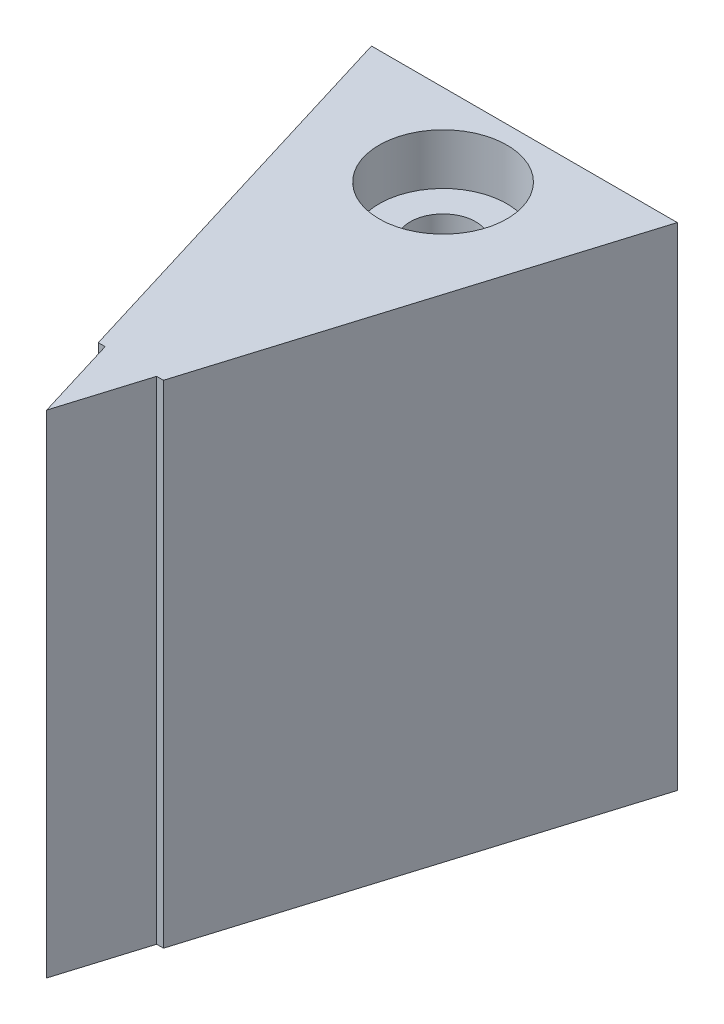
ISO-10303-21;
HEADER;
FILE_DESCRIPTION(('STEP AP214'),'2;1');
FILE_NAME('part.step','',(''),(''),'','','');
FILE_SCHEMA(('AUTOMOTIVE_DESIGN { 1 0 10303 214 1 1 1 1 }'));
ENDSEC;
DATA;
#1=APPLICATION_CONTEXT('core data for automotive mechanical design processes');
#2=APPLICATION_PROTOCOL_DEFINITION('international standard','automotive_design',2000,#1);
#3=PRODUCT_CONTEXT('',#1,'mechanical');
#4=PRODUCT('Part','Part','',(#3));
#5=PRODUCT_RELATED_PRODUCT_CATEGORY('part','',(#4));
#6=PRODUCT_DEFINITION_FORMATION('','',#4);
#7=PRODUCT_DEFINITION_CONTEXT('part definition',#1,'design');
#8=PRODUCT_DEFINITION('design','',#6,#7);
#9=PRODUCT_DEFINITION_SHAPE('','',#8);
#10=(LENGTH_UNIT() NAMED_UNIT(*) SI_UNIT(.MILLI.,.METRE.));
#11=(NAMED_UNIT(*) PLANE_ANGLE_UNIT() SI_UNIT($,.RADIAN.));
#12=(NAMED_UNIT(*) SI_UNIT($,.STERADIAN.) SOLID_ANGLE_UNIT());
#13=UNCERTAINTY_MEASURE_WITH_UNIT(LENGTH_MEASURE(1.E-05),#10,'distance_accuracy_value','');
#14=(GEOMETRIC_REPRESENTATION_CONTEXT(3) GLOBAL_UNCERTAINTY_ASSIGNED_CONTEXT((#13)) GLOBAL_UNIT_ASSIGNED_CONTEXT((#10,
#11,#12)) REPRESENTATION_CONTEXT('',''));
#15=CARTESIAN_POINT('',(0.,0.,0.));
#16=DIRECTION('',(0.,0.,1.));
#17=DIRECTION('',(1.,0.,0.));
#18=AXIS2_PLACEMENT_3D('',#15,#16,#17);
#19=CARTESIAN_POINT('',(-1.01365400260447,-2.51,16.5653700090289));
#20=DIRECTION('',(0.,0.,-1.));
#21=DIRECTION('',(-1.,0.,0.));
#22=AXIS2_PLACEMENT_3D('',#19,#20,#21);
#23=PLANE('',#22);
#24=DIRECTION('',(0.,1.,0.));
#25=VECTOR('',#24,1.);
#26=CARTESIAN_POINT('',(-0.804515651307037,-2.51,16.5653700090289));
#27=LINE('',#26,#25);
#28=CARTESIAN_POINT('',(-0.804515651307037,-2.5,16.5653700090289));
#29=VERTEX_POINT('',#28);
#30=CARTESIAN_POINT('',(-0.804515651307037,12.5,16.5653700090289));
#31=VERTEX_POINT('',#30);
#32=EDGE_CURVE('E11',#29,#31,#27,.T.);
#33=ORIENTED_EDGE('',*,*,#32,.T.);
#34=DIRECTION('',(-1.,0.,0.));
#35=VECTOR('',#34,1.);
#36=CARTESIAN_POINT('',(0.,12.5,16.5653700090289));
#37=LINE('',#36,#35);
#38=CARTESIAN_POINT('',(-1.01365400260447,12.5,16.5653700090289));
#39=VERTEX_POINT('',#38);
#40=EDGE_CURVE('E196',#31,#39,#37,.T.);
#41=ORIENTED_EDGE('',*,*,#40,.T.);
#42=DIRECTION('',(0.,-1.,0.));
#43=VECTOR('',#42,1.);
#44=CARTESIAN_POINT('',(-1.01365400260447,-2.5,16.5653700090289));
#45=LINE('',#44,#43);
#46=CARTESIAN_POINT('',(-1.01365400260447,-2.5,16.5653700090289));
#47=VERTEX_POINT('',#46);
#48=EDGE_CURVE('E54',#39,#47,#45,.T.);
#49=ORIENTED_EDGE('',*,*,#48,.T.);
#50=DIRECTION('',(-1.,0.,0.));
#51=VECTOR('',#50,1.);
#52=CARTESIAN_POINT('',(0.,-2.5,16.5653700090289));
#53=LINE('',#52,#51);
#54=EDGE_CURVE('E184',#29,#47,#53,.T.);
#55=ORIENTED_EDGE('',*,*,#54,.F.);
#56=EDGE_LOOP('',(#33,#41,#49,#55));
#57=FACE_BOUND('',#56,.T.);
#58=ADVANCED_FACE('F37',(#57),#23,.F.);
#59=CARTESIAN_POINT('',(-0.0200292878637935,-2.51,19.1313092850622));
#60=DIRECTION('',(0.956304755963033,0.,-0.292371704722745));
#61=DIRECTION('',(-0.292371704722745,0.,-0.956304755963033));
#62=AXIS2_PLACEMENT_3D('',#59,#60,#61);
#63=PLANE('',#62);
#64=DIRECTION('',(0.,1.,0.));
#65=VECTOR('',#64,1.);
#66=CARTESIAN_POINT('',(-0.0200292878637935,-2.51,19.1313092850622));
#67=LINE('',#66,#65);
#68=CARTESIAN_POINT('',(-0.0200292878637948,-2.5,19.1313092850622));
#69=VERTEX_POINT('',#68);
#70=CARTESIAN_POINT('',(-0.0200292878637948,12.5,19.1313092850622));
#71=VERTEX_POINT('',#70);
#72=EDGE_CURVE('E46',#69,#71,#67,.T.);
#73=ORIENTED_EDGE('',*,*,#72,.T.);
#74=DIRECTION('',(-0.292371704722745,0.,-0.956304755963033));
#75=VECTOR('',#74,1.);
#76=CARTESIAN_POINT('',(-5.36736335318275,12.5,1.64096765560485));
#77=LINE('',#76,#75);
#78=EDGE_CURVE('E199',#71,#31,#77,.T.);
#79=ORIENTED_EDGE('',*,*,#78,.T.);
#80=ORIENTED_EDGE('',*,*,#32,.F.);
#81=DIRECTION('',(-0.292371704722745,0.,-0.956304755963033));
#82=VECTOR('',#81,1.);
#83=CARTESIAN_POINT('',(-5.36736335318275,-2.5,1.64096765560485));
#84=LINE('',#83,#82);
#85=EDGE_CURVE('E214',#69,#29,#84,.T.);
#86=ORIENTED_EDGE('',*,*,#85,.F.);
#87=EDGE_LOOP('',(#73,#79,#80,#86));
#88=FACE_BOUND('',#87,.T.);
#89=ADVANCED_FACE('F230',(#88),#63,.F.);
#90=CARTESIAN_POINT('',(0.764457075579426,-2.51,16.5653700090289));
#91=DIRECTION('',(-0.956304755963036,0.,-0.292371704722737));
#92=DIRECTION('',(-0.292371704722737,0.,0.956304755963036));
#93=AXIS2_PLACEMENT_3D('',#90,#91,#92);
#94=PLANE('',#93);
#95=DIRECTION('',(0.,1.,0.));
#96=VECTOR('',#95,1.);
#97=CARTESIAN_POINT('',(0.764457075579426,-2.51,16.5653700090289));
#98=LINE('',#97,#96);
#99=CARTESIAN_POINT('',(0.764457075579427,-2.5,16.5653700090289));
#100=VERTEX_POINT('',#99);
#101=CARTESIAN_POINT('',(0.764457075579427,12.5,16.5653700090289));
#102=VERTEX_POINT('',#101);
#103=EDGE_CURVE('E198',#100,#102,#98,.T.);
#104=ORIENTED_EDGE('',*,*,#103,.T.);
#105=DIRECTION('',(-0.292371704722737,0.,0.956304755963036));
#106=VECTOR('',#105,1.);
#107=CARTESIAN_POINT('',(5.33072903312821,12.5,1.62976741996975));
#108=LINE('',#107,#106);
#109=EDGE_CURVE('E202',#102,#71,#108,.T.);
#110=ORIENTED_EDGE('',*,*,#109,.T.);
#111=ORIENTED_EDGE('',*,*,#72,.F.);
#112=DIRECTION('',(-0.292371704722737,0.,0.956304755963036));
#113=VECTOR('',#112,1.);
#114=CARTESIAN_POINT('',(5.33072903312821,-2.5,1.62976741996975));
#115=LINE('',#114,#113);
#116=EDGE_CURVE('E216',#100,#69,#115,.T.);
#117=ORIENTED_EDGE('',*,*,#116,.F.);
#118=EDGE_LOOP('',(#104,#110,#111,#117));
#119=FACE_BOUND('',#118,.T.);
#120=ADVANCED_FACE('F228',(#119),#94,.F.);
#121=CARTESIAN_POINT('',(0.973595426876855,-2.51,16.5653700090289));
#122=DIRECTION('',(0.,0.,-1.));
#123=DIRECTION('',(-1.,0.,0.));
#124=AXIS2_PLACEMENT_3D('',#121,#122,#123);
#125=PLANE('',#124);
#126=DIRECTION('',(0.,1.,0.));
#127=VECTOR('',#126,1.);
#128=CARTESIAN_POINT('',(0.973595426876858,-2.5,16.5653700090289));
#129=LINE('',#128,#127);
#130=CARTESIAN_POINT('',(0.973595426876858,-2.5,16.5653700090289));
#131=VERTEX_POINT('',#130);
#132=CARTESIAN_POINT('',(0.973595426876858,12.5,16.5653700090289));
#133=VERTEX_POINT('',#132);
#134=EDGE_CURVE('E206',#131,#133,#129,.T.);
#135=ORIENTED_EDGE('',*,*,#134,.T.);
#136=DIRECTION('',(-1.,0.,0.));
#137=VECTOR('',#136,1.);
#138=CARTESIAN_POINT('',(0.,12.5,16.5653700090289));
#139=LINE('',#138,#137);
#140=EDGE_CURVE('E62',#133,#102,#139,.T.);
#141=ORIENTED_EDGE('',*,*,#140,.T.);
#142=ORIENTED_EDGE('',*,*,#103,.F.);
#143=DIRECTION('',(-1.,0.,0.));
#144=VECTOR('',#143,1.);
#145=CARTESIAN_POINT('',(0.,-2.5,16.5653700090289));
#146=LINE('',#145,#144);
#147=EDGE_CURVE('E41',#131,#100,#146,.T.);
#148=ORIENTED_EDGE('',*,*,#147,.F.);
#149=EDGE_LOOP('',(#135,#141,#142,#148));
#150=FACE_BOUND('',#149,.T.);
#151=ADVANCED_FACE('F39',(#150),#125,.F.);
#152=CARTESIAN_POINT('',(-0.0200292878638651,5.,9.56537000902889));
#153=DIRECTION('',(0.,0.,-1.));
#154=DIRECTION('',(-1.,0.,0.));
#155=AXIS2_PLACEMENT_3D('',#152,#153,#154);
#156=PLANE('',#155);
#157=CARTESIAN_POINT('',(-0.0200292878638651,5.,9.56537000902889));
#158=DIRECTION('',(0.,0.,-1.));
#159=DIRECTION('',(-1.,0.,0.));
#160=AXIS2_PLACEMENT_3D('',#157,#158,#159);
#161=CIRCLE('',#160,3.05);
#162=CARTESIAN_POINT('',(2.87824606137402,4.05,9.56537000902889));
#163=VERTEX_POINT('',#162);
#164=CARTESIAN_POINT('',(-2.91830463710175,4.05,9.56537000902889));
#165=VERTEX_POINT('',#164);
#166=EDGE_CURVE('E151',#163,#165,#161,.T.);
#167=ORIENTED_EDGE('',*,*,#166,.T.);
#168=DIRECTION('',(1.,0.,0.));
#169=VECTOR('',#168,1.);
#170=CARTESIAN_POINT('',(2.87824606137402,4.05,9.56537000902889));
#171=LINE('',#170,#169);
#172=EDGE_CURVE('E154',#165,#163,#171,.T.);
#173=ORIENTED_EDGE('',*,*,#172,.T.);
#174=EDGE_LOOP('',(#167,#173));
#175=FACE_BOUND('',#174,.T.);
#176=ADVANCED_FACE('F307',(#175),#156,.T.);
#177=CARTESIAN_POINT('',(0.,-2.5,7.06537000902889));
#178=DIRECTION('',(0.,1.,0.));
#179=DIRECTION('',(0.,0.,1.));
#180=AXIS2_PLACEMENT_3D('',#177,#178,#179);
#181=CYLINDRICAL_SURFACE('',#180,0.999999999999795);
#182=CARTESIAN_POINT('',(0.,5.95,7.06537000902889));
#183=DIRECTION('',(0.,-1.,0.));
#184=DIRECTION('',(0.,0.,-1.));
#185=AXIS2_PLACEMENT_3D('',#182,#183,#184);
#186=CIRCLE('',#185,0.999999999999795);
#187=CARTESIAN_POINT('',(0.,5.95,6.06537000902909));
#188=VERTEX_POINT('',#187);
#189=EDGE_CURVE('E187',#188,#188,#186,.T.);
#190=ORIENTED_EDGE('',*,*,#189,.F.);
#191=EDGE_LOOP('',(#190));
#192=FACE_BOUND('',#191,.T.);
#193=CARTESIAN_POINT('',(0.,4.05,7.06537000902889));
#194=DIRECTION('',(0.,1.,0.));
#195=DIRECTION('',(0.,0.,1.));
#196=AXIS2_PLACEMENT_3D('',#193,#194,#195);
#197=CIRCLE('',#196,0.999999999999795);
#198=CARTESIAN_POINT('',(0.,4.05,8.06537000902868));
#199=VERTEX_POINT('',#198);
#200=EDGE_CURVE('E264',#199,#199,#197,.T.);
#201=ORIENTED_EDGE('',*,*,#200,.F.);
#202=EDGE_LOOP('',(#201));
#203=FACE_BOUND('',#202,.T.);
#204=ADVANCED_FACE('F274',(#192,#203),#181,.F.);
#205=CARTESIAN_POINT('',(-0.0200292878638651,5.,9.56537000902889));
#206=DIRECTION('',(0.,0.,-1.));
#207=DIRECTION('',(-1.,0.,0.));
#208=AXIS2_PLACEMENT_3D('',#205,#206,#207);
#209=PLANE('',#208);
#210=CARTESIAN_POINT('',(-0.0200292878638651,5.,9.56537000902889));
#211=DIRECTION('',(0.,0.,-1.));
#212=DIRECTION('',(-1.,0.,0.));
#213=AXIS2_PLACEMENT_3D('',#210,#211,#212);
#214=CIRCLE('',#213,3.05);
#215=CARTESIAN_POINT('',(-2.91830463710175,5.95,9.56537000902889));
#216=VERTEX_POINT('',#215);
#217=CARTESIAN_POINT('',(2.87824606137402,5.95,9.56537000902889));
#218=VERTEX_POINT('',#217);
#219=EDGE_CURVE('E127',#216,#218,#214,.T.);
#220=ORIENTED_EDGE('',*,*,#219,.T.);
#221=DIRECTION('',(-1.,0.,0.));
#222=VECTOR('',#221,1.);
#223=CARTESIAN_POINT('',(2.87824606137402,5.95,9.56537000902889));
#224=LINE('',#223,#222);
#225=EDGE_CURVE('E136',#218,#216,#224,.T.);
#226=ORIENTED_EDGE('',*,*,#225,.T.);
#227=EDGE_LOOP('',(#220,#226));
#228=FACE_BOUND('',#227,.T.);
#229=ADVANCED_FACE('F139',(#228),#209,.T.);
#230=CARTESIAN_POINT('',(0.,8.04993423332826,8.06537000902868));
#231=CARTESIAN_POINT('',(0.0546821791008591,8.04957510796066,8.06537003134291));
#232=CARTESIAN_POINT('',(0.109354914126314,8.04773172784493,8.0608700796451));
#233=CARTESIAN_POINT('',(0.217072928600975,8.04124911512673,8.0430513451388));
#234=CARTESIAN_POINT('',(0.270117951898954,8.03660944482241,8.02973118167488));
#235=CARTESIAN_POINT('',(0.373013096085542,8.02501178523379,7.9947834956713));
#236=CARTESIAN_POINT('',(0.422868473539478,8.01805773388006,7.97317007466059));
#237=CARTESIAN_POINT('',(0.518239677542278,8.00251631313627,7.92231226129294));
#238=CARTESIAN_POINT('',(0.563754694999946,7.99392864011109,7.89306644995588));
#239=CARTESIAN_POINT('',(0.650728756928365,7.97567153728033,7.82670873711478));
#240=CARTESIAN_POINT('',(0.692016888170353,7.96597671144104,7.789379829442));
#241=CARTESIAN_POINT('',(0.767869116779319,7.94673554743408,7.7083762283634));
#242=CARTESIAN_POINT('',(0.802431776578928,7.93718924141278,7.66470018173609));
#243=CARTESIAN_POINT('',(0.864765151781457,7.91902793004534,7.5707826132558));
#244=CARTESIAN_POINT('',(0.892326299349008,7.91044519441132,7.52039518357941));
#245=CARTESIAN_POINT('',(0.938505856826815,7.89556616206647,7.41536260915563));
#246=CARTESIAN_POINT('',(0.957127077871142,7.88926914676962,7.36071880910146));
#247=CARTESIAN_POINT('',(0.984242433141647,7.87995461814357,7.25073786122397));
#248=CARTESIAN_POINT('',(0.993067689027361,7.87683020189835,7.19549165552765));
#249=CARTESIAN_POINT('',(1.00137637507627,7.87389140563375,7.0842210997125));
#250=CARTESIAN_POINT('',(1.00086267310011,7.87407600946129,7.02819699375629));
#251=CARTESIAN_POINT('',(0.99076096088365,7.87764266918273,6.91967266210838));
#252=CARTESIAN_POINT('',(0.981587657973599,7.88087859001705,6.86712821582431));
#253=CARTESIAN_POINT('',(0.955100149434765,7.8899509641507,6.76437204334019));
#254=CARTESIAN_POINT('',(0.937784973426303,7.89578772742408,6.71416059597993));
#255=CARTESIAN_POINT('',(0.895224866547381,7.90952145894585,6.61653210436769));
#256=CARTESIAN_POINT('',(0.869854126003332,7.91745075100137,6.56917464604347));
#257=CARTESIAN_POINT('',(0.811993742784764,7.93447527343163,6.47925869308694));
#258=CARTESIAN_POINT('',(0.779502046774439,7.94357083978839,6.43670158801433));
#259=CARTESIAN_POINT('',(0.706310455681535,7.96250407370069,6.35524458013623));
#260=CARTESIAN_POINT('',(0.665269123333407,7.97235562915799,6.31665408360598));
#261=CARTESIAN_POINT('',(0.57718349640282,7.99129803558887,6.24682351617368));
#262=CARTESIAN_POINT('',(0.530138584475256,8.00038880817212,6.21558420213093));
#263=CARTESIAN_POINT('',(0.430676287465459,8.01694054662288,6.16106484602444));
#264=CARTESIAN_POINT('',(0.378205748438876,8.0243825903494,6.13787563631923));
#265=CARTESIAN_POINT('',(0.269803272333861,8.03668686866806,6.10075330920549));
#266=CARTESIAN_POINT('',(0.213872509814023,8.04154997336318,6.08681706955583));
#267=CARTESIAN_POINT('',(0.102675980012124,8.04801791966975,6.06913107849329));
#268=CARTESIAN_POINT('',(0.0474822649655247,8.04975195790472,6.06497514173016));
#269=CARTESIAN_POINT('',(-0.0628415625782379,8.05019803748363,6.0658238541015));
#270=CARTESIAN_POINT('',(-0.11797168444029,8.04891060250071,6.07082691579136));
#271=CARTESIAN_POINT('',(-0.224905098860222,8.04356865345438,6.0895227717292));
#272=CARTESIAN_POINT('',(-0.27675855569376,8.03959688095123,6.10295488916953));
#273=CARTESIAN_POINT('',(-0.377465816854332,8.02940636298488,6.13781410513821));
#274=CARTESIAN_POINT('',(-0.426319262034692,8.02318734910412,6.15924215873627));
#275=CARTESIAN_POINT('',(-0.520961047176242,8.00897230857037,6.2100604659352));
#276=CARTESIAN_POINT('',(-0.566646489467878,8.0009368899842,6.2396309979426));
#277=CARTESIAN_POINT('',(-0.65254261544519,7.98401517307969,6.30568228657445));
#278=CARTESIAN_POINT('',(-0.692751707956591,7.97512862873551,6.34216504424128));
#279=CARTESIAN_POINT('',(-0.768368832186386,7.9570367257478,6.42287653863802));
#280=CARTESIAN_POINT('',(-0.803492685593696,7.94783427305369,6.46737277538544));
#281=CARTESIAN_POINT('',(-0.865812896971176,7.93056297373217,6.561814306128));
#282=CARTESIAN_POINT('',(-0.893009191170616,7.92249413622404,6.61175964395225));
#283=CARTESIAN_POINT('',(-0.938600028099442,7.908487452095,6.71573217026841));
#284=CARTESIAN_POINT('',(-0.957006080265417,7.90254682148472,6.76975391336835));
#285=CARTESIAN_POINT('',(-0.984385447206509,7.89356679235751,6.88036261430816));
#286=CARTESIAN_POINT('',(-0.993362642639482,7.89052620031194,6.93694850680402));
#287=CARTESIAN_POINT('',(-1.00133163032267,7.88782991758724,7.04818230585044));
#288=CARTESIAN_POINT('',(-1.00077845522218,7.8880199719282,7.10279422493158));
#289=CARTESIAN_POINT('',(-0.990816979227545,7.89138344959095,7.21110590212351));
#290=CARTESIAN_POINT('',(-0.981409159874996,7.89455671067717,7.26480570967594));
#291=CARTESIAN_POINT('',(-0.954326006544325,7.90340934975765,7.36885594585062));
#292=CARTESIAN_POINT('',(-0.936795159679116,7.9090448351629,7.41924801009586));
#293=CARTESIAN_POINT('',(-0.894078597598813,7.92216267155434,7.51641516301269));
#294=CARTESIAN_POINT('',(-0.868891247980455,7.92964541680364,7.56318947674054));
#295=CARTESIAN_POINT('',(-0.810369867509382,7.94598359665686,7.6538685388687));
#296=CARTESIAN_POINT('',(-0.776744477808668,7.95488269367938,7.69757735474066));
#297=CARTESIAN_POINT('',(-0.702796321419838,7.97283954400193,7.77888143930107));
#298=CARTESIAN_POINT('',(-0.662471761379352,7.98189733920272,7.81647506561977));
#299=CARTESIAN_POINT('',(-0.574566833244119,7.99951060425292,7.88580532807814));
#300=CARTESIAN_POINT('',(-0.526781666832324,8.00803733466461,7.91729045245042));
#301=CARTESIAN_POINT('',(-0.42631739774142,8.02324420992155,7.97174481231142));
#302=CARTESIAN_POINT('',(-0.373639825535698,8.02992492966523,7.99471669981805));
#303=CARTESIAN_POINT('',(-0.268082191246842,8.04033135878708,8.03027889077588));
#304=CARTESIAN_POINT('',(-0.215395649662781,8.0442075496374,8.0433995880839));
#305=CARTESIAN_POINT('',(-0.108469393021745,8.04918673358594,8.06094409709436));
#306=CARTESIAN_POINT('',(-0.0542300522364904,8.05029038935139,8.06536998689896));
#307=CARTESIAN_POINT('',(0.,8.04993423332826,8.06537000902868));
#308=B_SPLINE_CURVE_WITH_KNOTS('',3,(#230,#231,#232,#233,#234,#235,#236,#237,#238,#239,#240,
#241,#242,#243,#244,#245,#246,#247,#248,#249,#250,#251,#252,#253,#254,#255,#256,#257,#258,#259,
#260,#261,#262,#263,#264,#265,#266,#267,#268,#269,#270,#271,#272,#273,#274,#275,#276,#277,#278,
#279,#280,#281,#282,#283,#284,#285,#286,#287,#288,#289,#290,#291,#292,#293,#294,#295,#296,#297,
#298,#299,#300,#301,#302,#303,#304,#305,#306,#307),.UNSPECIFIED.,.T.,.F.,(4,2,2,2,2,2,2,2,2,2,2,
2,2,2,2,2,2,2,2,2,2,2,2,2,2,2,2,2,2,2,2,2,2,2,2,2,2,2,4),(0.,0.163850025249576,
0.327725704522648,0.491323962064708,0.654952656763252,0.823688007705309,0.992459386251062,
1.16580686426493,1.33909979790541,1.50633759959778,1.67352404581624,1.83308952664912,
1.99267402993055,2.15488479838887,2.31714240219587,2.48792062945066,2.65871643191758,
2.83138111770078,3.00398751137513,3.16928819199399,3.33456022528501,3.49495717905625,
3.65537329747941,3.81967478229688,3.98402390415546,4.15550728499603,4.32699204524211,
4.49825165341348,4.66944074819149,4.83247997411711,4.99551033400225,5.15574601024891,
5.31601591541804,5.48284858292629,5.64972598333098,5.8224532304353,5.99512662474744,
6.15766074540814,6.32015601487876),.UNSPECIFIED.);
#309=CARTESIAN_POINT('',(0.,8.04993423332826,8.06537000902868));
#310=VERTEX_POINT('',#309);
#311=EDGE_CURVE('E190',#310,#310,#308,.T.);
#312=ORIENTED_EDGE('',*,*,#311,.F.);
#313=EDGE_LOOP('',(#312));
#314=FACE_BOUND('',#313,.T.);
#315=CARTESIAN_POINT('',(0.,10.95,7.06537000902889));
#316=DIRECTION('',(0.,1.,0.));
#317=DIRECTION('',(0.,0.,1.));
#318=AXIS2_PLACEMENT_3D('',#315,#316,#317);
#319=CIRCLE('',#318,0.999999999999795);
#320=CARTESIAN_POINT('',(0.,10.95,8.06537000902868));
#321=VERTEX_POINT('',#320);
#322=EDGE_CURVE('E192',#321,#321,#319,.F.);
#323=ORIENTED_EDGE('',*,*,#322,.F.);
#324=EDGE_LOOP('',(#323));
#325=FACE_BOUND('',#324,.T.);
#326=ADVANCED_FACE('F273',(#314,#325),#181,.F.);
#327=CARTESIAN_POINT('',(0.,10.95,7.06537000902889));
#328=DIRECTION('',(0.,1.,0.));
#329=DIRECTION('',(0.,0.,1.));
#330=AXIS2_PLACEMENT_3D('',#327,#328,#329);
#331=PLANE('',#330);
#332=CARTESIAN_POINT('',(0.,10.95,7.06537000902889));
#333=DIRECTION('',(0.,1.,0.));
#334=DIRECTION('',(0.,0.,1.));
#335=AXIS2_PLACEMENT_3D('',#332,#333,#334);
#336=CIRCLE('',#335,1.95);
#337=CARTESIAN_POINT('',(0.,10.95,9.01537000902889));
#338=VERTEX_POINT('',#337);
#339=EDGE_CURVE('E195',#338,#338,#336,.T.);
#340=ORIENTED_EDGE('',*,*,#339,.T.);
#341=EDGE_LOOP('',(#340));
#342=FACE_BOUND('',#341,.T.);
#343=ORIENTED_EDGE('',*,*,#322,.T.);
#344=EDGE_LOOP('',(#343));
#345=FACE_BOUND('',#344,.T.);
#346=ADVANCED_FACE('F324',(#342,#345),#331,.T.);
#347=CARTESIAN_POINT('',(2.87824606137402,4.05,9.56537000902889));
#348=DIRECTION('',(0.,1.,0.));
#349=DIRECTION('',(0.,0.,1.));
#350=AXIS2_PLACEMENT_3D('',#347,#348,#349);
#351=PLANE('',#350);
#352=ORIENTED_EDGE('',*,*,#200,.T.);
#353=EDGE_LOOP('',(#352));
#354=FACE_BOUND('',#353,.T.);
#355=DIRECTION('',(1.,0.,0.));
#356=VECTOR('',#355,1.);
#357=CARTESIAN_POINT('',(2.87824606137402,4.05,4.56537000902889));
#358=LINE('',#357,#356);
#359=CARTESIAN_POINT('',(-2.91830463710175,4.05,4.56537000902889));
#360=VERTEX_POINT('',#359);
#361=CARTESIAN_POINT('',(2.87824606137402,4.05,4.56537000902889));
#362=VERTEX_POINT('',#361);
#363=EDGE_CURVE('E155',#360,#362,#358,.T.);
#364=ORIENTED_EDGE('',*,*,#363,.T.);
#365=DIRECTION('',(0.,0.,-1.));
#366=VECTOR('',#365,1.);
#367=CARTESIAN_POINT('',(2.87824606137402,4.05,9.56537000902889));
#368=LINE('',#367,#366);
#369=EDGE_CURVE('E162',#163,#362,#368,.T.);
#370=ORIENTED_EDGE('',*,*,#369,.F.);
#371=ORIENTED_EDGE('',*,*,#172,.F.);
#372=DIRECTION('',(0.,0.,-1.));
#373=VECTOR('',#372,1.);
#374=CARTESIAN_POINT('',(-2.91830463710175,4.05,9.56537000902889));
#375=LINE('',#374,#373);
#376=EDGE_CURVE('E158',#165,#360,#375,.T.);
#377=ORIENTED_EDGE('',*,*,#376,.T.);
#378=EDGE_LOOP('',(#364,#370,#371,#377));
#379=FACE_BOUND('',#378,.T.);
#380=ADVANCED_FACE('F287',(#354,#379),#351,.F.);
#381=CARTESIAN_POINT('',(-0.0200292878638651,5.,9.56537000902889));
#382=DIRECTION('',(0.,0.,-1.));
#383=DIRECTION('',(-1.,0.,0.));
#384=AXIS2_PLACEMENT_3D('',#381,#382,#383);
#385=CYLINDRICAL_SURFACE('',#384,3.05);
#386=CARTESIAN_POINT('',(0.,1.95006576667174,8.06537000902868));
#387=CARTESIAN_POINT('',(-0.0545467083170213,1.94970747285087,8.06537014842768));
#388=CARTESIAN_POINT('',(-0.109102594425875,1.95082617973328,8.0608924995377));
#389=CARTESIAN_POINT('',(-0.216630559947825,1.95586683343102,8.04314372343465));
#390=CARTESIAN_POINT('',(-0.269602455019722,1.95978910520613,8.02987157686885));
#391=CARTESIAN_POINT('',(-0.372395540865111,1.96998281568037,7.9950275098491));
#392=CARTESIAN_POINT('',(-0.422221565195225,1.97625054265354,7.973468701733));
#393=CARTESIAN_POINT('',(-0.517558158763021,1.99046661490332,7.92272142069787));
#394=CARTESIAN_POINT('',(-0.563067913976883,1.9984152762853,7.89353151248061));
#395=CARTESIAN_POINT('',(-0.649966255197754,2.0154231807719,7.82735020137387));
#396=CARTESIAN_POINT('',(-0.691194169171496,2.02450822082243,7.79015451043477));
#397=CARTESIAN_POINT('',(-0.766956256715783,2.04261595831002,7.7094526800914));
#398=CARTESIAN_POINT('',(-0.801489039696813,2.05163864242117,7.66594523299885));
#399=CARTESIAN_POINT('',(-0.863833114798163,2.06886144062743,7.57236170710818));
#400=CARTESIAN_POINT('',(-0.891427757355958,2.07703123807653,7.5221351619421));
#401=CARTESIAN_POINT('',(-0.937715224095409,2.09122999962885,7.41745339240553));
#402=CARTESIAN_POINT('',(-0.956410489644233,2.09725955075052,7.36299933254285));
#403=CARTESIAN_POINT('',(-0.98378774157987,2.10623552314352,7.25316209699885));
#404=CARTESIAN_POINT('',(-0.992758921547917,2.10927073194073,7.19785848159756));
#405=CARTESIAN_POINT('',(-1.00133622536939,2.1121705310223,7.08645414512163));
#406=CARTESIAN_POINT('',(-1.00094504098822,2.11203603262665,7.03035365779079));
#407=CARTESIAN_POINT('',(-0.991038308718468,2.10869152283109,6.92147912268892));
#408=CARTESIAN_POINT('',(-0.981911130689609,2.10561242249054,6.86866501351363));
#409=CARTESIAN_POINT('',(-0.955426185023448,2.09694560803578,6.76536168143749));
#410=CARTESIAN_POINT('',(-0.938067486579282,2.09135761022334,6.71487272216934));
#411=CARTESIAN_POINT('',(-0.895355477528405,2.07821837470153,6.6167672431692));
#412=CARTESIAN_POINT('',(-0.869886126954097,2.07063893932841,6.5692051855977));
#413=CARTESIAN_POINT('',(-0.811753224255465,2.05439616233121,6.47890419675966));
#414=CARTESIAN_POINT('',(-0.779087700884409,2.04573252399295,6.43616659191586));
#415=CARTESIAN_POINT('',(-0.705621370189618,2.02780243830253,6.35455640683283));
#416=CARTESIAN_POINT('',(-0.664503649472307,2.01852709526581,6.31597050530051));
#417=CARTESIAN_POINT('',(-0.57625917050636,2.00081162712214,6.24616898216816));
#418=CARTESIAN_POINT('',(-0.529131951252226,1.99237156618035,6.21495392653086));
#419=CARTESIAN_POINT('',(-0.42967631027486,1.97721392807559,6.16059752963539));
#420=CARTESIAN_POINT('',(-0.377310405391615,1.97051020892516,6.13752064297751));
#421=CARTESIAN_POINT('',(-0.269171299120882,1.9597079998363,6.10058591678685));
#422=CARTESIAN_POINT('',(-0.213399241292621,1.95560864074058,6.08672500152104));
#423=CARTESIAN_POINT('',(-0.10253908456766,1.95063259271298,6.06912548318687));
#424=CARTESIAN_POINT('',(-0.0475199824239522,1.94962825812152,6.06498767267624));
#425=CARTESIAN_POINT('',(0.0624178408306011,1.95061930503421,6.06580783262257));
#426=CARTESIAN_POINT('',(0.117336575934049,1.95261423039507,6.07076441998072));
#427=CARTESIAN_POINT('',(0.224019697915292,1.95932166494474,6.08932142334608));
#428=CARTESIAN_POINT('',(0.275829029613629,1.96396161104079,6.10269199072763));
#429=CARTESIAN_POINT('',(0.376441018754687,1.97545416982598,6.1374016340776));
#430=CARTESIAN_POINT('',(0.425243272951458,1.98230707850544,6.15874177606015));
#431=CARTESIAN_POINT('',(0.519942958677845,1.99778474493448,6.20943615236094));
#432=CARTESIAN_POINT('',(0.565724086676077,2.00645292462781,6.23899404054972));
#433=CARTESIAN_POINT('',(0.65180500165392,2.02458793082162,6.30504407730197));
#434=CARTESIAN_POINT('',(0.692103118494657,2.03405499924922,6.34153833062207));
#435=CARTESIAN_POINT('',(0.767932225486806,2.05327037108428,6.42234306540777));
#436=CARTESIAN_POINT('',(0.803172677487142,2.06301253612594,6.46692833440378));
#437=CARTESIAN_POINT('',(0.865699423276716,2.08125899142385,6.5616021249502));
#438=CARTESIAN_POINT('',(0.892985766856479,2.08976328942864,6.61169061204926));
#439=CARTESIAN_POINT('',(0.938651779165637,2.10448494111707,6.71586576519746));
#440=CARTESIAN_POINT('',(0.957065998669795,2.11071114322027,6.76993596046547));
#441=CARTESIAN_POINT('',(0.984445615434366,2.12011390689645,6.88066589489971));
#442=CARTESIAN_POINT('',(0.993415282022461,2.12329184635206,6.93732445192374));
#443=CARTESIAN_POINT('',(1.00132679388868,2.12609197133263,7.04845788777591));
#444=CARTESIAN_POINT('',(1.00076507768828,2.12589019545742,7.10289342027352));
#445=CARTESIAN_POINT('',(0.990844746741187,2.12238627741313,7.21085016959212));
#446=CARTESIAN_POINT('',(0.981486635847406,2.11908431282127,7.26437143860285));
#447=CARTESIAN_POINT('',(0.954582416471499,2.1098742046831,7.36800345557402));
#448=CARTESIAN_POINT('',(0.937190144831295,2.10401513574912,7.41815883854906));
#449=CARTESIAN_POINT('',(0.894835988822796,2.090358382842,7.51487803621554));
#450=CARTESIAN_POINT('',(0.869872431323104,2.08256027044038,7.56144105419678));
#451=CARTESIAN_POINT('',(0.811804845722808,2.06546338643234,7.65187315687851));
#452=CARTESIAN_POINT('',(0.778391036585527,2.05611369258926,7.69553364274029));
#453=CARTESIAN_POINT('',(0.704904242322278,2.03716191630836,7.77678571189248));
#454=CARTESIAN_POINT('',(0.664829330890099,2.02755976154021,7.81437553340602));
#455=CARTESIAN_POINT('',(0.577262492650444,2.0087087644859,7.88391432033876));
#456=CARTESIAN_POINT('',(0.529540250451134,1.99948882586492,7.91558208528871));
#457=CARTESIAN_POINT('',(0.42915302715261,1.98282933317401,7.97040925400301));
#458=CARTESIAN_POINT('',(0.376489408870778,1.97538929021161,7.99357099509525));
#459=CARTESIAN_POINT('',(0.270526055479718,1.96342787080536,8.02962243255354));
#460=CARTESIAN_POINT('',(0.21740168051063,1.95877488381879,8.04298349104672));
#461=CARTESIAN_POINT('',(0.109520989825704,1.95227407622703,8.06085600970638));
#462=CARTESIAN_POINT('',(0.0547651206314484,1.95042549514897,8.06536986907151));
#463=CARTESIAN_POINT('',(0.,1.95006576667174,8.06537000902868));
#464=B_SPLINE_CURVE_WITH_KNOTS('',3,(#386,#387,#388,#389,#390,#391,#392,#393,#394,#395,#396,
#397,#398,#399,#400,#401,#402,#403,#404,#405,#406,#407,#408,#409,#410,#411,#412,#413,#414,#415,
#416,#417,#418,#419,#420,#421,#422,#423,#424,#425,#426,#427,#428,#429,#430,#431,#432,#433,#434,
#435,#436,#437,#438,#439,#440,#441,#442,#443,#444,#445,#446,#447,#448,#449,#450,#451,#452,#453,
#454,#455,#456,#457,#458,#459,#460,#461,#462,#463),.UNSPECIFIED.,.T.,.F.,(4,2,2,2,2,2,2,2,2,2,2,
2,2,2,2,2,2,2,2,2,2,2,2,2,2,2,2,2,2,2,2,2,2,2,2,2,2,2,4),(0.,0.163442738145022,
0.326904423927134,0.490108515076376,0.653343324638449,0.821381387841708,0.989454315519196,
1.16225995148931,1.33501815430968,1.50248425360626,1.66990220544567,1.83020712775361,
1.99053018140408,2.15325864915569,2.31603174864767,2.48667281288232,2.65732697535582,
2.82930387628821,3.00122335289978,3.16595058911983,3.33065277528572,3.49104017270917,
3.65144903131624,3.81625518004188,3.98111141728132,4.15327611944035,4.32543974387269,
4.49692737970757,4.66833746273024,4.83084843459238,4.993350098478,5.15286155264116,
5.31240828196405,5.4789731824826,5.64558633552872,5.81877562096729,5.9919172809142,
6.15605898403024,6.32015616875538),.UNSPECIFIED.);
#465=CARTESIAN_POINT('',(0.,1.95006576667174,8.06537000902868));
#466=VERTEX_POINT('',#465);
#467=EDGE_CURVE('E147',#466,#466,#464,.T.);
#468=ORIENTED_EDGE('',*,*,#467,.T.);
#469=EDGE_LOOP('',(#468));
#470=FACE_BOUND('',#469,.T.);
#471=CARTESIAN_POINT('',(-0.0200292878638651,5.,4.56537000902889));
#472=DIRECTION('',(0.,0.,-1.));
#473=DIRECTION('',(-1.,0.,0.));
#474=AXIS2_PLACEMENT_3D('',#471,#472,#473);
#475=CIRCLE('',#474,3.05);
#476=EDGE_CURVE('E149',#362,#360,#475,.T.);
#477=ORIENTED_EDGE('',*,*,#476,.T.);
#478=ORIENTED_EDGE('',*,*,#376,.F.);
#479=ORIENTED_EDGE('',*,*,#166,.F.);
#480=ORIENTED_EDGE('',*,*,#369,.T.);
#481=EDGE_LOOP('',(#477,#478,#479,#480));
#482=FACE_BOUND('',#481,.T.);
#483=ADVANCED_FACE('F283',(#470,#482),#385,.F.);
#484=CARTESIAN_POINT('',(2.87824606137402,5.95,9.56537000902889));
#485=DIRECTION('',(0.,-1.,0.));
#486=DIRECTION('',(0.,0.,-1.));
#487=AXIS2_PLACEMENT_3D('',#484,#485,#486);
#488=PLANE('',#487);
#489=ORIENTED_EDGE('',*,*,#189,.T.);
#490=EDGE_LOOP('',(#489));
#491=FACE_BOUND('',#490,.T.);
#492=DIRECTION('',(-1.,0.,0.));
#493=VECTOR('',#492,1.);
#494=CARTESIAN_POINT('',(2.87824606137402,5.95,4.56537000902889));
#495=LINE('',#494,#493);
#496=CARTESIAN_POINT('',(2.87824606137402,5.95,4.56537000902889));
#497=VERTEX_POINT('',#496);
#498=CARTESIAN_POINT('',(-2.91830463710175,5.95,4.56537000902889));
#499=VERTEX_POINT('',#498);
#500=EDGE_CURVE('E140',#497,#499,#495,.T.);
#501=ORIENTED_EDGE('',*,*,#500,.T.);
#502=DIRECTION('',(0.,0.,-1.));
#503=VECTOR('',#502,1.);
#504=CARTESIAN_POINT('',(-2.91830463710175,5.95,9.56537000902889));
#505=LINE('',#504,#503);
#506=EDGE_CURVE('E135',#216,#499,#505,.T.);
#507=ORIENTED_EDGE('',*,*,#506,.F.);
#508=ORIENTED_EDGE('',*,*,#225,.F.);
#509=DIRECTION('',(0.,0.,-1.));
#510=VECTOR('',#509,1.);
#511=CARTESIAN_POINT('',(2.87824606137402,5.95,9.56537000902889));
#512=LINE('',#511,#510);
#513=EDGE_CURVE('E124',#218,#497,#512,.T.);
#514=ORIENTED_EDGE('',*,*,#513,.T.);
#515=EDGE_LOOP('',(#501,#507,#508,#514));
#516=FACE_BOUND('',#515,.T.);
#517=ADVANCED_FACE('F142',(#491,#516),#488,.F.);
#518=CARTESIAN_POINT('',(-0.0200292878638651,5.,9.56537000902889));
#519=DIRECTION('',(0.,0.,-1.));
#520=DIRECTION('',(-1.,0.,0.));
#521=AXIS2_PLACEMENT_3D('',#518,#519,#520);
#522=CYLINDRICAL_SURFACE('',#521,3.05);
#523=ORIENTED_EDGE('',*,*,#311,.T.);
#524=EDGE_LOOP('',(#523));
#525=FACE_BOUND('',#524,.T.);
#526=CARTESIAN_POINT('',(-0.0200292878638651,5.,4.56537000902889));
#527=DIRECTION('',(0.,0.,-1.));
#528=DIRECTION('',(-1.,0.,0.));
#529=AXIS2_PLACEMENT_3D('',#526,#527,#528);
#530=CIRCLE('',#529,3.05);
#531=EDGE_CURVE('E130',#499,#497,#530,.T.);
#532=ORIENTED_EDGE('',*,*,#531,.T.);
#533=ORIENTED_EDGE('',*,*,#513,.F.);
#534=ORIENTED_EDGE('',*,*,#219,.F.);
#535=ORIENTED_EDGE('',*,*,#506,.T.);
#536=EDGE_LOOP('',(#532,#533,#534,#535));
#537=FACE_BOUND('',#536,.T.);
#538=ADVANCED_FACE('F126',(#525,#537),#522,.F.);
#539=CARTESIAN_POINT('',(0.,10.95,7.06537000902889));
#540=DIRECTION('',(0.,1.,0.));
#541=DIRECTION('',(0.,0.,1.));
#542=AXIS2_PLACEMENT_3D('',#539,#540,#541);
#543=CYLINDRICAL_SURFACE('',#542,1.95);
#544=CARTESIAN_POINT('',(0.,12.5,7.06537000902889));
#545=DIRECTION('',(0.,1.,0.));
#546=DIRECTION('',(0.,0.,1.));
#547=AXIS2_PLACEMENT_3D('',#544,#545,#546);
#548=CIRCLE('',#547,1.95);
#549=CARTESIAN_POINT('',(0.,12.5,9.01537000902889));
#550=VERTEX_POINT('',#549);
#551=EDGE_CURVE('E249',#550,#550,#548,.T.);
#552=CARTESIAN_POINT('',(0.,10.95,9.01537000902889));
#553=CARTESIAN_POINT('',(0.,10.9661458333333,9.01537000902889));
#554=CARTESIAN_POINT('',(0.,10.9822916666667,9.01537000902889));
#555=CARTESIAN_POINT('',(0.,11.0145833333333,9.01537000902889));
#556=CARTESIAN_POINT('',(0.,11.0307291666667,9.01537000902889));
#557=CARTESIAN_POINT('',(0.,11.0630208333333,9.01537000902889));
#558=CARTESIAN_POINT('',(0.,11.0791666666667,9.01537000902889));
#559=CARTESIAN_POINT('',(0.,11.1114583333333,9.01537000902889));
#560=CARTESIAN_POINT('',(0.,11.1276041666667,9.01537000902889));
#561=CARTESIAN_POINT('',(0.,11.1598958333333,9.01537000902889));
#562=CARTESIAN_POINT('',(0.,11.1760416666667,9.01537000902889));
#563=CARTESIAN_POINT('',(0.,11.2083333333333,9.01537000902889));
#564=CARTESIAN_POINT('',(0.,11.2244791666667,9.01537000902889));
#565=CARTESIAN_POINT('',(0.,11.2567708333333,9.01537000902889));
#566=CARTESIAN_POINT('',(0.,11.2729166666667,9.01537000902889));
#567=CARTESIAN_POINT('',(0.,11.3052083333333,9.01537000902889));
#568=CARTESIAN_POINT('',(0.,11.3213541666667,9.01537000902889));
#569=CARTESIAN_POINT('',(0.,11.3536458333333,9.01537000902889));
#570=CARTESIAN_POINT('',(0.,11.3697916666667,9.01537000902889));
#571=CARTESIAN_POINT('',(0.,11.4020833333333,9.01537000902889));
#572=CARTESIAN_POINT('',(0.,11.4182291666667,9.01537000902889));
#573=CARTESIAN_POINT('',(0.,11.4505208333333,9.01537000902889));
#574=CARTESIAN_POINT('',(0.,11.4666666666667,9.01537000902889));
#575=CARTESIAN_POINT('',(0.,11.4989583333333,9.01537000902889));
#576=CARTESIAN_POINT('',(0.,11.5151041666667,9.01537000902889));
#577=CARTESIAN_POINT('',(0.,11.5473958333333,9.01537000902889));
#578=CARTESIAN_POINT('',(0.,11.5635416666667,9.01537000902889));
#579=CARTESIAN_POINT('',(0.,11.5958333333333,9.01537000902889));
#580=CARTESIAN_POINT('',(0.,11.6119791666667,9.01537000902889));
#581=CARTESIAN_POINT('',(0.,11.6442708333333,9.01537000902889));
#582=CARTESIAN_POINT('',(0.,11.6604166666667,9.01537000902889));
#583=CARTESIAN_POINT('',(0.,11.6927083333333,9.01537000902889));
#584=CARTESIAN_POINT('',(0.,11.7088541666667,9.01537000902889));
#585=CARTESIAN_POINT('',(0.,11.7411458333333,9.01537000902889));
#586=CARTESIAN_POINT('',(0.,11.7572916666667,9.01537000902889));
#587=CARTESIAN_POINT('',(0.,11.7895833333333,9.01537000902889));
#588=CARTESIAN_POINT('',(0.,11.8057291666667,9.01537000902889));
#589=CARTESIAN_POINT('',(0.,11.8380208333333,9.01537000902889));
#590=CARTESIAN_POINT('',(0.,11.8541666666667,9.01537000902889));
#591=CARTESIAN_POINT('',(0.,11.8864583333333,9.01537000902889));
#592=CARTESIAN_POINT('',(0.,11.9026041666667,9.01537000902889));
#593=CARTESIAN_POINT('',(0.,11.9348958333333,9.01537000902889));
#594=CARTESIAN_POINT('',(0.,11.9510416666667,9.01537000902889));
#595=CARTESIAN_POINT('',(0.,11.9833333333333,9.01537000902889));
#596=CARTESIAN_POINT('',(0.,11.9994791666667,9.01537000902889));
#597=CARTESIAN_POINT('',(0.,12.0317708333333,9.01537000902889));
#598=CARTESIAN_POINT('',(0.,12.0479166666667,9.01537000902889));
#599=CARTESIAN_POINT('',(0.,12.0802083333333,9.01537000902889));
#600=CARTESIAN_POINT('',(0.,12.0963541666667,9.01537000902889));
#601=CARTESIAN_POINT('',(0.,12.1286458333333,9.01537000902889));
#602=CARTESIAN_POINT('',(0.,12.1447916666667,9.01537000902889));
#603=CARTESIAN_POINT('',(0.,12.1770833333333,9.01537000902889));
#604=CARTESIAN_POINT('',(0.,12.1932291666667,9.01537000902889));
#605=CARTESIAN_POINT('',(0.,12.2255208333333,9.01537000902889));
#606=CARTESIAN_POINT('',(0.,12.2416666666667,9.01537000902889));
#607=CARTESIAN_POINT('',(0.,12.2739583333333,9.01537000902889));
#608=CARTESIAN_POINT('',(0.,12.2901041666667,9.01537000902889));
#609=CARTESIAN_POINT('',(0.,12.3223958333333,9.01537000902889));
#610=CARTESIAN_POINT('',(0.,12.3385416666667,9.01537000902889));
#611=CARTESIAN_POINT('',(0.,12.3708333333333,9.01537000902889));
#612=CARTESIAN_POINT('',(0.,12.3869791666667,9.01537000902889));
#613=CARTESIAN_POINT('',(0.,12.4192708333333,9.01537000902889));
#614=CARTESIAN_POINT('',(0.,12.4354166666667,9.01537000902889));
#615=CARTESIAN_POINT('',(0.,12.4677083333333,9.01537000902889));
#616=CARTESIAN_POINT('',(0.,12.4838541666667,9.01537000902889));
#617=CARTESIAN_POINT('',(0.,12.5,9.01537000902889));
#618=B_SPLINE_CURVE_WITH_KNOTS('',3,(#552,#553,#554,#555,#556,#557,#558,#559,#560,#561,#562,
#563,#564,#565,#566,#567,#568,#569,#570,#571,#572,#573,#574,#575,#576,#577,#578,#579,#580,#581,
#582,#583,#584,#585,#586,#587,#588,#589,#590,#591,#592,#593,#594,#595,#596,#597,#598,#599,#600,
#601,#602,#603,#604,#605,#606,#607,#608,#609,#610,#611,#612,#613,#614,#615,#616,#617),
.UNSPECIFIED.,.F.,.F.,(4,2,2,2,2,2,2,2,2,2,2,2,2,2,2,2,2,2,2,2,2,2,2,2,2,2,2,2,2,2,2,2,4),(0.,
0.0484375000000016,0.0968750000000015,0.145312500000001,0.193750000000001,0.242187500000001,
0.290625000000001,0.339062500000001,0.387500000000001,0.435937500000001,0.484375,0.5328125,
0.58125,0.6296875,0.678125,0.7265625,0.775,0.823437500000001,0.871875000000001,
0.920312500000001,0.968750000000001,1.0171875,1.065625,1.1140625,1.1625,1.2109375,1.259375,
1.3078125,1.35625,1.4046875,1.453125,1.5015625,1.55),.UNSPECIFIED.);
#619=EDGE_CURVE('BSEAM275',#338,#550,#618,.T.);
#620=ORIENTED_EDGE('',*,*,#339,.F.);
#621=ORIENTED_EDGE('',*,*,#551,.T.);
#622=ORIENTED_EDGE('',*,*,#619,.T.);
#623=ORIENTED_EDGE('',*,*,#619,.F.);
#624=EDGE_LOOP('',(#620,#622,#621,#623));
#625=FACE_BOUND('',#624,.T.);
#626=ADVANCED_FACE('F275',(#625),#543,.F.);
#627=CARTESIAN_POINT('',(-1.01365400260447,-2.5,16.5653700090289));
#628=DIRECTION('',(-0.956304755963033,0.,0.292371704722745));
#629=DIRECTION('',(0.292371704722745,0.,0.956304755963033));
#630=AXIS2_PLACEMENT_3D('',#627,#628,#629);
#631=PLANE('',#630);
#632=ORIENTED_EDGE('',*,*,#48,.F.);
#633=DIRECTION('',(0.292371704722747,0.,0.956304755963032));
#634=VECTOR('',#633,1.);
#635=CARTESIAN_POINT('',(-0.0200292878637907,12.5,19.8153700090289));
#636=LINE('',#635,#634);
#637=CARTESIAN_POINT('',(-4.68242218010851,12.5,4.56537000902889));
#638=VERTEX_POINT('',#637);
#639=EDGE_CURVE('E164',#638,#39,#636,.T.);
#640=ORIENTED_EDGE('',*,*,#639,.F.);
#641=DIRECTION('',(0.,1.,0.));
#642=VECTOR('',#641,1.);
#643=CARTESIAN_POINT('',(-4.68242218010851,-2.5,4.56537000902889));
#644=LINE('',#643,#642);
#645=CARTESIAN_POINT('',(-4.68242218010851,-2.5,4.56537000902889));
#646=VERTEX_POINT('',#645);
#647=EDGE_CURVE('E182',#646,#638,#644,.T.);
#648=ORIENTED_EDGE('',*,*,#647,.F.);
#649=DIRECTION('',(0.292371704722747,0.,0.956304755963032));
#650=VECTOR('',#649,1.);
#651=CARTESIAN_POINT('',(-0.0200292878637907,-2.5,19.8153700090289));
#652=LINE('',#651,#650);
#653=EDGE_CURVE('E174',#646,#47,#652,.T.);
#654=ORIENTED_EDGE('',*,*,#653,.T.);
#655=EDGE_LOOP('',(#632,#640,#648,#654));
#656=FACE_BOUND('',#655,.T.);
#657=ADVANCED_FACE('F234',(#656),#631,.T.);
#658=CARTESIAN_POINT('',(4.64236360438078,-2.5,4.56537000902889));
#659=DIRECTION('',(0.,0.,-1.));
#660=DIRECTION('',(-1.,0.,0.));
#661=AXIS2_PLACEMENT_3D('',#658,#659,#660);
#662=PLANE('',#661);
#663=ORIENTED_EDGE('',*,*,#531,.F.);
#664=ORIENTED_EDGE('',*,*,#500,.F.);
#665=EDGE_LOOP('',(#663,#664));
#666=FACE_BOUND('',#665,.T.);
#667=ORIENTED_EDGE('',*,*,#476,.F.);
#668=ORIENTED_EDGE('',*,*,#363,.F.);
#669=EDGE_LOOP('',(#667,#668));
#670=FACE_BOUND('',#669,.T.);
#671=ORIENTED_EDGE('',*,*,#647,.T.);
#672=DIRECTION('',(-1.,0.,0.));
#673=VECTOR('',#672,1.);
#674=CARTESIAN_POINT('',(4.64236360438078,12.5,4.56537000902889));
#675=LINE('',#674,#673);
#676=CARTESIAN_POINT('',(4.64236360438078,12.5,4.56537000902889));
#677=VERTEX_POINT('',#676);
#678=EDGE_CURVE('E171',#677,#638,#675,.T.);
#679=ORIENTED_EDGE('',*,*,#678,.F.);
#680=DIRECTION('',(0.,1.,0.));
#681=VECTOR('',#680,1.);
#682=CARTESIAN_POINT('',(4.64236360438078,-2.5,4.56537000902889));
#683=LINE('',#682,#681);
#684=CARTESIAN_POINT('',(4.64236360438078,-2.5,4.56537000902889));
#685=VERTEX_POINT('',#684);
#686=EDGE_CURVE('E181',#685,#677,#683,.T.);
#687=ORIENTED_EDGE('',*,*,#686,.F.);
#688=DIRECTION('',(-1.,0.,0.));
#689=VECTOR('',#688,1.);
#690=CARTESIAN_POINT('',(4.64236360438078,-2.5,4.56537000902889));
#691=LINE('',#690,#689);
#692=EDGE_CURVE('E178',#685,#646,#691,.T.);
#693=ORIENTED_EDGE('',*,*,#692,.T.);
#694=EDGE_LOOP('',(#671,#679,#687,#693));
#695=FACE_BOUND('',#694,.T.);
#696=ADVANCED_FACE('F238',(#666,#670,#695),#662,.T.);
#697=CARTESIAN_POINT('',(0.973595426876858,-2.5,16.5653700090289));
#698=DIRECTION('',(0.956304755963036,0.,0.292371704722736));
#699=DIRECTION('',(0.292371704722736,0.,-0.956304755963036));
#700=AXIS2_PLACEMENT_3D('',#697,#698,#699);
#701=PLANE('',#700);
#702=ORIENTED_EDGE('',*,*,#134,.F.);
#703=DIRECTION('',(0.292371704722737,0.,-0.956304755963035));
#704=VECTOR('',#703,1.);
#705=CARTESIAN_POINT('',(0.973595426876858,-2.5,16.5653700090289));
#706=LINE('',#705,#704);
#707=EDGE_CURVE('E176',#131,#685,#706,.T.);
#708=ORIENTED_EDGE('',*,*,#707,.T.);
#709=ORIENTED_EDGE('',*,*,#686,.T.);
#710=DIRECTION('',(0.292371704722737,0.,-0.956304755963035));
#711=VECTOR('',#710,1.);
#712=CARTESIAN_POINT('',(0.973595426876858,12.5,16.5653700090289));
#713=LINE('',#712,#711);
#714=EDGE_CURVE('E169',#133,#677,#713,.T.);
#715=ORIENTED_EDGE('',*,*,#714,.F.);
#716=EDGE_LOOP('',(#702,#708,#709,#715));
#717=FACE_BOUND('',#716,.T.);
#718=ADVANCED_FACE('F241',(#717),#701,.T.);
#719=CARTESIAN_POINT('',(0.,12.5,0.));
#720=DIRECTION('',(0.,1.,0.));
#721=DIRECTION('',(0.,0.,1.));
#722=AXIS2_PLACEMENT_3D('',#719,#720,#721);
#723=PLANE('',#722);
#724=ORIENTED_EDGE('',*,*,#140,.F.);
#725=ORIENTED_EDGE('',*,*,#714,.T.);
#726=ORIENTED_EDGE('',*,*,#678,.T.);
#727=ORIENTED_EDGE('',*,*,#639,.T.);
#728=ORIENTED_EDGE('',*,*,#40,.F.);
#729=ORIENTED_EDGE('',*,*,#78,.F.);
#730=ORIENTED_EDGE('',*,*,#109,.F.);
#731=EDGE_LOOP('',(#724,#725,#726,#727,#728,#729,#730));
#732=FACE_BOUND('',#731,.T.);
#733=ORIENTED_EDGE('',*,*,#551,.F.);
#734=EDGE_LOOP('',(#733));
#735=FACE_BOUND('',#734,.T.);
#736=ADVANCED_FACE('F242',(#732,#735),#723,.T.);
#737=CARTESIAN_POINT('',(0.,-2.5,7.06537000902889));
#738=DIRECTION('',(0.,1.,0.));
#739=DIRECTION('',(0.,0.,1.));
#740=AXIS2_PLACEMENT_3D('',#737,#738,#739);
#741=CIRCLE('',#740,0.999999999999795);
#742=CARTESIAN_POINT('',(0.,-2.5,8.06537000902868));
#743=VERTEX_POINT('',#742);
#744=EDGE_CURVE('E191',#743,#743,#741,.T.);
#745=ORIENTED_EDGE('',*,*,#744,.F.);
#746=EDGE_LOOP('',(#745));
#747=FACE_BOUND('',#746,.T.);
#748=ORIENTED_EDGE('',*,*,#467,.F.);
#749=EDGE_LOOP('',(#748));
#750=FACE_BOUND('',#749,.T.);
#751=ADVANCED_FACE('F245',(#747,#750),#181,.F.);
#752=CARTESIAN_POINT('',(0.,-2.5,0.));
#753=DIRECTION('',(0.,1.,0.));
#754=DIRECTION('',(0.,0.,1.));
#755=AXIS2_PLACEMENT_3D('',#752,#753,#754);
#756=PLANE('',#755);
#757=ORIENTED_EDGE('',*,*,#744,.T.);
#758=EDGE_LOOP('',(#757));
#759=FACE_BOUND('',#758,.T.);
#760=ORIENTED_EDGE('',*,*,#707,.F.);
#761=ORIENTED_EDGE('',*,*,#147,.T.);
#762=ORIENTED_EDGE('',*,*,#116,.T.);
#763=ORIENTED_EDGE('',*,*,#85,.T.);
#764=ORIENTED_EDGE('',*,*,#54,.T.);
#765=ORIENTED_EDGE('',*,*,#653,.F.);
#766=ORIENTED_EDGE('',*,*,#692,.F.);
#767=EDGE_LOOP('',(#760,#761,#762,#763,#764,#765,#766));
#768=FACE_BOUND('',#767,.T.);
#769=ADVANCED_FACE('F223',(#759,#768),#756,.F.);
#770=CLOSED_SHELL('',(#58,#89,#120,#151,#176,#204,#229,#326,#346,#380,#483,#517,#538,#626,#657,
#696,#718,#736,#751,#769));
#771=MANIFOLD_SOLID_BREP('B2',#770);
#772=ADVANCED_BREP_SHAPE_REPRESENTATION('',(#18,#771),#14);
#773=SHAPE_DEFINITION_REPRESENTATION(#9,#772);
ENDSEC;
END-ISO-10303-21;
